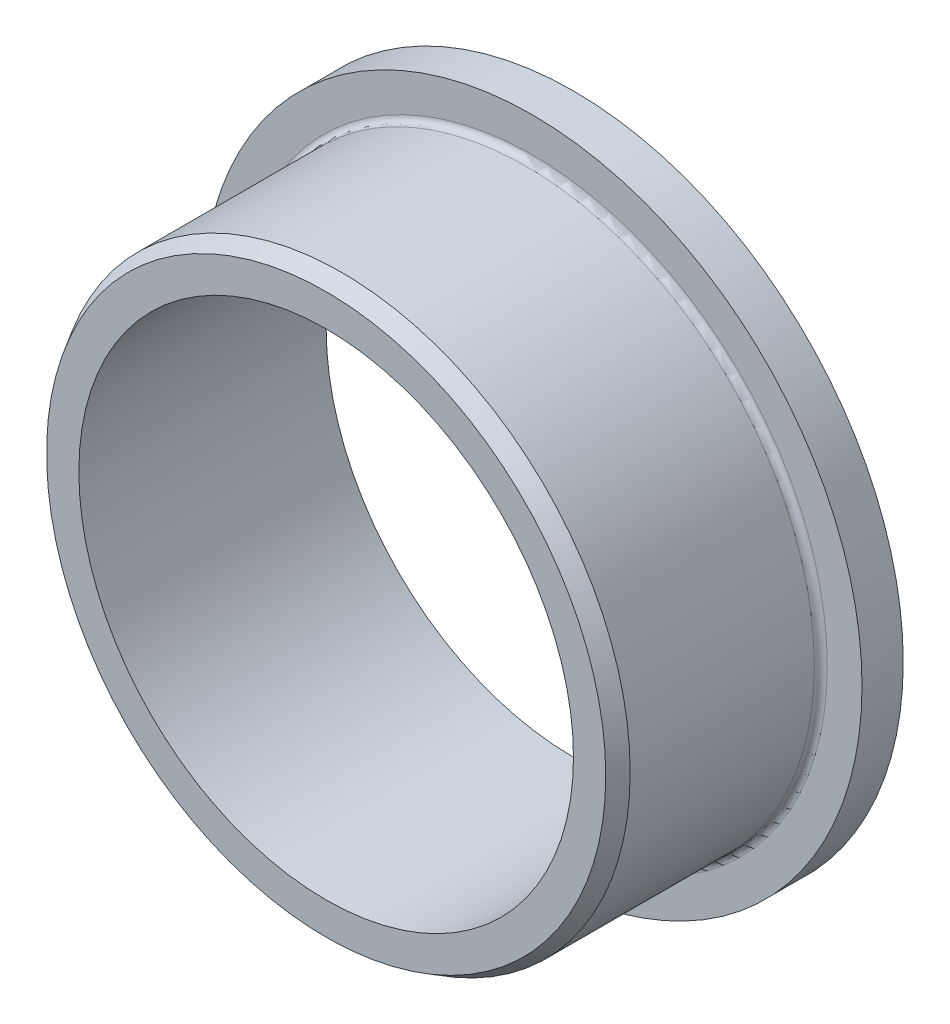
ISO-10303-21;
HEADER;
FILE_DESCRIPTION(('STEP AP214'),'2;1');
FILE_NAME('part.step','',(''),(''),'','','');
FILE_SCHEMA(('AUTOMOTIVE_DESIGN { 1 0 10303 214 1 1 1 1 }'));
ENDSEC;
DATA;
#1=APPLICATION_CONTEXT('core data for automotive mechanical design processes');
#2=APPLICATION_PROTOCOL_DEFINITION('international standard','automotive_design',2000,#1);
#3=PRODUCT_CONTEXT('',#1,'mechanical');
#4=PRODUCT('Part','Part','',(#3));
#5=PRODUCT_RELATED_PRODUCT_CATEGORY('part','',(#4));
#6=PRODUCT_DEFINITION_FORMATION('','',#4);
#7=PRODUCT_DEFINITION_CONTEXT('part definition',#1,'design');
#8=PRODUCT_DEFINITION('design','',#6,#7);
#9=PRODUCT_DEFINITION_SHAPE('','',#8);
#10=(LENGTH_UNIT() NAMED_UNIT(*) SI_UNIT(.MILLI.,.METRE.));
#11=(NAMED_UNIT(*) PLANE_ANGLE_UNIT() SI_UNIT($,.RADIAN.));
#12=(NAMED_UNIT(*) SI_UNIT($,.STERADIAN.) SOLID_ANGLE_UNIT());
#13=UNCERTAINTY_MEASURE_WITH_UNIT(LENGTH_MEASURE(1.E-05),#10,'distance_accuracy_value','');
#14=(GEOMETRIC_REPRESENTATION_CONTEXT(3) GLOBAL_UNCERTAINTY_ASSIGNED_CONTEXT((#13)) GLOBAL_UNIT_ASSIGNED_CONTEXT((#10,
#11,#12)) REPRESENTATION_CONTEXT('',''));
#15=CARTESIAN_POINT('',(0.,0.,0.));
#16=DIRECTION('',(0.,0.,1.));
#17=DIRECTION('',(1.,0.,0.));
#18=AXIS2_PLACEMENT_3D('',#15,#16,#17);
#19=CARTESIAN_POINT('',(0.,0.,0.));
#20=DIRECTION('',(0.,0.,1.));
#21=DIRECTION('',(1.,0.,0.));
#22=AXIS2_PLACEMENT_3D('',#19,#20,#21);
#23=CYLINDRICAL_SURFACE('',#22,25.4000000000207);
#24=CARTESIAN_POINT('',(0.,0.,0.));
#25=DIRECTION('',(0.,0.,1.));
#26=DIRECTION('',(1.,0.,0.));
#27=AXIS2_PLACEMENT_3D('',#24,#25,#26);
#28=CIRCLE('',#27,25.4000000000207);
#29=CARTESIAN_POINT('',(25.4000000000207,0.,0.));
#30=VERTEX_POINT('',#29);
#31=EDGE_CURVE('E56',#30,#30,#28,.T.);
#32=ORIENTED_EDGE('',*,*,#31,.T.);
#33=EDGE_LOOP('',(#32));
#34=FACE_BOUND('',#33,.T.);
#35=CARTESIAN_POINT('',(0.,0.,3.17500000001194));
#36=DIRECTION('',(0.,0.,1.));
#37=DIRECTION('',(1.,0.,0.));
#38=AXIS2_PLACEMENT_3D('',#35,#36,#37);
#39=CIRCLE('',#38,25.4000000000207);
#40=CARTESIAN_POINT('',(25.4000000000207,0.,3.17500000001194));
#41=VERTEX_POINT('',#40);
#42=EDGE_CURVE('E10',#41,#41,#39,.T.);
#43=ORIENTED_EDGE('',*,*,#42,.F.);
#44=EDGE_LOOP('',(#43));
#45=FACE_BOUND('',#44,.T.);
#46=ADVANCED_FACE('F28',(#34,#45),#23,.T.);
#47=CARTESIAN_POINT('',(22.7250000000207,0.,3.17500000001194));
#48=DIRECTION('',(0.,0.,1.));
#49=DIRECTION('',(1.,0.,0.));
#50=AXIS2_PLACEMENT_3D('',#47,#48,#49);
#51=PLANE('',#50);
#52=ORIENTED_EDGE('',*,*,#42,.T.);
#53=EDGE_LOOP('',(#52));
#54=FACE_BOUND('',#53,.T.);
#55=CARTESIAN_POINT('',(0.,0.,3.17500000001194));
#56=DIRECTION('',(0.,0.,1.));
#57=DIRECTION('',(1.,0.,0.));
#58=AXIS2_PLACEMENT_3D('',#55,#56,#57);
#59=CIRCLE('',#58,22.7250000000207);
#60=CARTESIAN_POINT('',(22.7250000000207,0.,3.17500000001194));
#61=VERTEX_POINT('',#60);
#62=EDGE_CURVE('E34',#61,#61,#59,.T.);
#63=ORIENTED_EDGE('',*,*,#62,.F.);
#64=EDGE_LOOP('',(#63));
#65=FACE_BOUND('',#64,.T.);
#66=ADVANCED_FACE('F74',(#54,#65),#51,.T.);
#67=CARTESIAN_POINT('',(0.,0.,3.67500000001194));
#68=DIRECTION('',(0.,0.,1.));
#69=DIRECTION('',(1.,0.,0.));
#70=AXIS2_PLACEMENT_3D('',#67,#68,#69);
#71=TOROIDAL_SURFACE('',#70,22.7250000000207,0.500000000000004);
#72=ORIENTED_EDGE('',*,*,#62,.T.);
#73=EDGE_LOOP('',(#72));
#74=FACE_BOUND('',#73,.T.);
#75=CARTESIAN_POINT('',(0.,0.,3.67500000001194));
#76=DIRECTION('',(0.,0.,1.));
#77=DIRECTION('',(1.,0.,0.));
#78=AXIS2_PLACEMENT_3D('',#75,#76,#77);
#79=CIRCLE('',#78,22.2250000000207);
#80=CARTESIAN_POINT('',(22.2250000000207,0.,3.67500000001194));
#81=VERTEX_POINT('',#80);
#82=EDGE_CURVE('E38',#81,#81,#79,.T.);
#83=ORIENTED_EDGE('',*,*,#82,.F.);
#84=EDGE_LOOP('',(#83));
#85=FACE_BOUND('',#84,.T.);
#86=ADVANCED_FACE('F78',(#74,#85),#71,.F.);
#87=CARTESIAN_POINT('',(0.,0.,0.));
#88=DIRECTION('',(0.,0.,1.));
#89=DIRECTION('',(1.,0.,0.));
#90=AXIS2_PLACEMENT_3D('',#87,#88,#89);
#91=CYLINDRICAL_SURFACE('',#90,22.2250000000207);
#92=ORIENTED_EDGE('',*,*,#82,.T.);
#93=EDGE_LOOP('',(#92));
#94=FACE_BOUND('',#93,.T.);
#95=CARTESIAN_POINT('',(0.,0.,17.8562));
#96=DIRECTION('',(0.,0.,1.));
#97=DIRECTION('',(1.,0.,0.));
#98=AXIS2_PLACEMENT_3D('',#95,#96,#97);
#99=CIRCLE('',#98,22.2250000000207);
#100=CARTESIAN_POINT('',(22.2250000000207,0.,17.8562));
#101=VERTEX_POINT('',#100);
#102=EDGE_CURVE('E42',#101,#101,#99,.T.);
#103=ORIENTED_EDGE('',*,*,#102,.F.);
#104=EDGE_LOOP('',(#103));
#105=FACE_BOUND('',#104,.T.);
#106=ADVANCED_FACE('F82',(#94,#105),#91,.T.);
#107=CARTESIAN_POINT('',(0.,0.,19.05));
#108=DIRECTION('',(0.,0.,-1.));
#109=DIRECTION('',(-1.,0.,0.));
#110=AXIS2_PLACEMENT_3D('',#107,#108,#109);
#111=CONICAL_SURFACE('',#110,21.5357592486621,0.523598775598296);
#112=ORIENTED_EDGE('',*,*,#102,.T.);
#113=EDGE_LOOP('',(#112));
#114=FACE_BOUND('',#113,.T.);
#115=CARTESIAN_POINT('',(0.,0.,19.05));
#116=DIRECTION('',(0.,0.,1.));
#117=DIRECTION('',(1.,0.,0.));
#118=AXIS2_PLACEMENT_3D('',#115,#116,#117);
#119=CIRCLE('',#118,21.5357592486621);
#120=CARTESIAN_POINT('',(21.5357592486621,0.,19.05));
#121=VERTEX_POINT('',#120);
#122=EDGE_CURVE('E47',#121,#121,#119,.T.);
#123=ORIENTED_EDGE('',*,*,#122,.F.);
#124=EDGE_LOOP('',(#123));
#125=FACE_BOUND('',#124,.T.);
#126=ADVANCED_FACE('F88',(#114,#125),#111,.T.);
#127=CARTESIAN_POINT('',(19.05,0.,19.05));
#128=DIRECTION('',(0.,0.,1.));
#129=DIRECTION('',(1.,0.,0.));
#130=AXIS2_PLACEMENT_3D('',#127,#128,#129);
#131=PLANE('',#130);
#132=ORIENTED_EDGE('',*,*,#122,.T.);
#133=EDGE_LOOP('',(#132));
#134=FACE_BOUND('',#133,.T.);
#135=CARTESIAN_POINT('',(0.,0.,19.05));
#136=DIRECTION('',(0.,0.,1.));
#137=DIRECTION('',(1.,0.,0.));
#138=AXIS2_PLACEMENT_3D('',#135,#136,#137);
#139=CIRCLE('',#138,19.05);
#140=CARTESIAN_POINT('',(19.05,0.,19.05));
#141=VERTEX_POINT('',#140);
#142=EDGE_CURVE('E50',#141,#141,#139,.T.);
#143=ORIENTED_EDGE('',*,*,#142,.F.);
#144=EDGE_LOOP('',(#143));
#145=FACE_BOUND('',#144,.T.);
#146=ADVANCED_FACE('F70',(#134,#145),#131,.T.);
#147=CARTESIAN_POINT('',(0.,0.,0.));
#148=DIRECTION('',(0.,0.,1.));
#149=DIRECTION('',(1.,0.,0.));
#150=AXIS2_PLACEMENT_3D('',#147,#148,#149);
#151=CYLINDRICAL_SURFACE('',#150,19.05);
#152=ORIENTED_EDGE('',*,*,#142,.T.);
#153=EDGE_LOOP('',(#152));
#154=FACE_BOUND('',#153,.T.);
#155=CARTESIAN_POINT('',(0.,0.,0.));
#156=DIRECTION('',(0.,0.,1.));
#157=DIRECTION('',(1.,0.,0.));
#158=AXIS2_PLACEMENT_3D('',#155,#156,#157);
#159=CIRCLE('',#158,19.05);
#160=CARTESIAN_POINT('',(19.05,0.,0.));
#161=VERTEX_POINT('',#160);
#162=EDGE_CURVE('E53',#161,#161,#159,.T.);
#163=ORIENTED_EDGE('',*,*,#162,.F.);
#164=EDGE_LOOP('',(#163));
#165=FACE_BOUND('',#164,.T.);
#166=ADVANCED_FACE('F64',(#154,#165),#151,.F.);
#167=CARTESIAN_POINT('',(25.4000000000207,0.,0.));
#168=DIRECTION('',(0.,0.,-1.));
#169=DIRECTION('',(-1.,0.,0.));
#170=AXIS2_PLACEMENT_3D('',#167,#168,#169);
#171=PLANE('',#170);
#172=ORIENTED_EDGE('',*,*,#162,.T.);
#173=EDGE_LOOP('',(#172));
#174=FACE_BOUND('',#173,.T.);
#175=ORIENTED_EDGE('',*,*,#31,.F.);
#176=EDGE_LOOP('',(#175));
#177=FACE_BOUND('',#176,.T.);
#178=ADVANCED_FACE('F62',(#174,#177),#171,.T.);
#179=CLOSED_SHELL('',(#46,#66,#86,#106,#126,#146,#166,#178));
#180=MANIFOLD_SOLID_BREP('B2',#179);
#181=ADVANCED_BREP_SHAPE_REPRESENTATION('',(#18,#180),#14);
#182=SHAPE_DEFINITION_REPRESENTATION(#9,#181);
ENDSEC;
END-ISO-10303-21;
